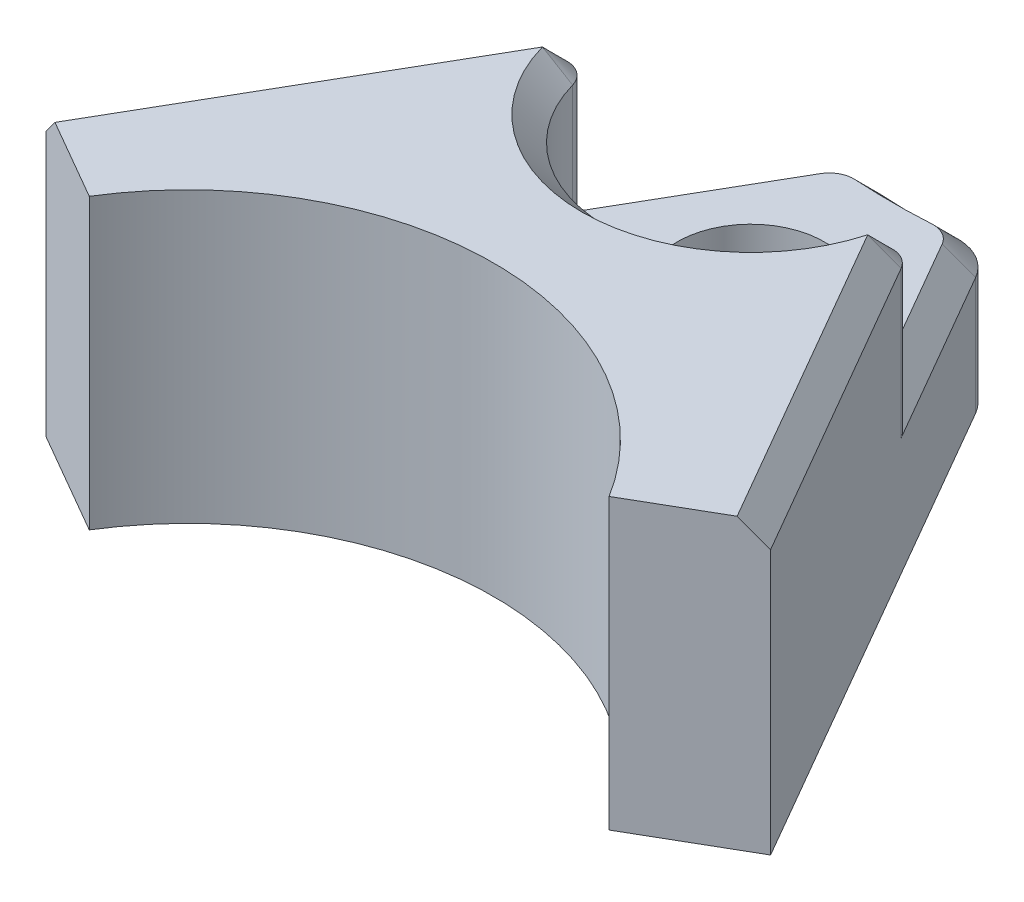
ISO-10303-21;
HEADER;
FILE_DESCRIPTION(('STEP AP214'),'2;1');
FILE_NAME('part.step','',(''),(''),'','','');
FILE_SCHEMA(('AUTOMOTIVE_DESIGN { 1 0 10303 214 1 1 1 1 }'));
ENDSEC;
DATA;
#1=APPLICATION_CONTEXT('core data for automotive mechanical design processes');
#2=APPLICATION_PROTOCOL_DEFINITION('international standard','automotive_design',2000,#1);
#3=PRODUCT_CONTEXT('',#1,'mechanical');
#4=PRODUCT('Part','Part','',(#3));
#5=PRODUCT_RELATED_PRODUCT_CATEGORY('part','',(#4));
#6=PRODUCT_DEFINITION_FORMATION('','',#4);
#7=PRODUCT_DEFINITION_CONTEXT('part definition',#1,'design');
#8=PRODUCT_DEFINITION('design','',#6,#7);
#9=PRODUCT_DEFINITION_SHAPE('','',#8);
#10=(LENGTH_UNIT() NAMED_UNIT(*) SI_UNIT(.MILLI.,.METRE.));
#11=(NAMED_UNIT(*) PLANE_ANGLE_UNIT() SI_UNIT($,.RADIAN.));
#12=(NAMED_UNIT(*) SI_UNIT($,.STERADIAN.) SOLID_ANGLE_UNIT());
#13=UNCERTAINTY_MEASURE_WITH_UNIT(LENGTH_MEASURE(1.E-05),#10,'distance_accuracy_value','');
#14=(GEOMETRIC_REPRESENTATION_CONTEXT(3) GLOBAL_UNCERTAINTY_ASSIGNED_CONTEXT((#13)) GLOBAL_UNIT_ASSIGNED_CONTEXT((#10,
#11,#12)) REPRESENTATION_CONTEXT('',''));
#15=CARTESIAN_POINT('',(0.,0.,0.));
#16=DIRECTION('',(0.,0.,1.));
#17=DIRECTION('',(1.,0.,0.));
#18=AXIS2_PLACEMENT_3D('',#15,#16,#17);
#19=CARTESIAN_POINT('',(0.,5.9,-27.39));
#20=DIRECTION('',(0.,-1.,0.));
#21=DIRECTION('',(0.,0.,-1.));
#22=AXIS2_PLACEMENT_3D('',#19,#20,#21);
#23=CYLINDRICAL_SURFACE('',#22,12.5);
#24=DIRECTION('',(0.,-1.,0.));
#25=VECTOR('',#24,1.);
#26=CARTESIAN_POINT('',(-0.751403671485057,5.9,-14.9126047380682));
#27=LINE('',#26,#25);
#28=CARTESIAN_POINT('',(-0.751403671485057,0.,-14.9126047380682));
#29=VERTEX_POINT('',#28);
#30=CARTESIAN_POINT('',(-0.751403671485057,2.40000000000002,-14.9126047380682));
#31=VERTEX_POINT('',#30);
#32=EDGE_CURVE('E214',#29,#31,#27,.F.);
#33=ORIENTED_EDGE('',*,*,#32,.T.);
#34=CARTESIAN_POINT('',(0.,2.40000000000002,-27.39));
#35=DIRECTION('',(0.,1.,0.));
#36=DIRECTION('',(0.,0.,1.));
#37=AXIS2_PLACEMENT_3D('',#34,#35,#36);
#38=CIRCLE('',#37,12.5);
#39=CARTESIAN_POINT('',(0.751403671485056,2.40000000000002,-14.9126047380682));
#40=VERTEX_POINT('',#39);
#41=EDGE_CURVE('E237',#31,#40,#38,.T.);
#42=ORIENTED_EDGE('',*,*,#41,.T.);
#43=DIRECTION('',(0.,-1.,0.));
#44=VECTOR('',#43,1.);
#45=CARTESIAN_POINT('',(0.751403671485056,5.9,-14.9126047380682));
#46=LINE('',#45,#44);
#47=CARTESIAN_POINT('',(0.751403671485056,0.,-14.9126047380682));
#48=VERTEX_POINT('',#47);
#49=EDGE_CURVE('E212',#40,#48,#46,.T.);
#50=ORIENTED_EDGE('',*,*,#49,.T.);
#51=CARTESIAN_POINT('',(0.,0.,-27.39));
#52=DIRECTION('',(0.,-1.,0.));
#53=DIRECTION('',(0.,0.,1.));
#54=AXIS2_PLACEMENT_3D('',#51,#52,#53);
#55=CIRCLE('',#54,12.5);
#56=EDGE_CURVE('E304',#48,#29,#55,.T.);
#57=ORIENTED_EDGE('',*,*,#56,.T.);
#58=EDGE_LOOP('',(#33,#42,#50,#57));
#59=FACE_BOUND('',#58,.T.);
#60=ADVANCED_FACE('F32',(#59),#23,.F.);
#61=CARTESIAN_POINT('',(0.,5.9,-11.5));
#62=DIRECTION('',(0.,-1.,0.));
#63=DIRECTION('',(0.,0.,-1.));
#64=AXIS2_PLACEMENT_3D('',#61,#62,#63);
#65=CYLINDRICAL_SURFACE('',#64,1.5);
#66=CARTESIAN_POINT('',(0.,0.,-11.5));
#67=DIRECTION('',(0.,1.,0.));
#68=DIRECTION('',(0.,0.,1.));
#69=AXIS2_PLACEMENT_3D('',#66,#67,#68);
#70=CIRCLE('',#69,1.5);
#71=CARTESIAN_POINT('',(0.,0.,-10.));
#72=VERTEX_POINT('',#71);
#73=EDGE_CURVE('E193',#72,#72,#70,.T.);
#74=ORIENTED_EDGE('',*,*,#73,.F.);
#75=EDGE_LOOP('',(#74));
#76=FACE_BOUND('',#75,.T.);
#77=CARTESIAN_POINT('',(0.,2.9,-11.5));
#78=DIRECTION('',(0.,1.,0.));
#79=DIRECTION('',(0.,0.,1.));
#80=AXIS2_PLACEMENT_3D('',#77,#78,#79);
#81=CIRCLE('',#80,1.5);
#82=CARTESIAN_POINT('',(0.,2.9,-10.));
#83=VERTEX_POINT('',#82);
#84=EDGE_CURVE('E191',#83,#83,#81,.T.);
#85=ORIENTED_EDGE('',*,*,#84,.T.);
#86=EDGE_LOOP('',(#85));
#87=FACE_BOUND('',#86,.T.);
#88=ADVANCED_FACE('F383',(#76,#87),#65,.F.);
#89=CARTESIAN_POINT('',(0.,5.9,0.));
#90=DIRECTION('',(0.,-1.,0.));
#91=DIRECTION('',(0.,0.,-1.));
#92=AXIS2_PLACEMENT_3D('',#89,#90,#91);
#93=PLANE('',#92);
#94=CARTESIAN_POINT('',(0.,5.9,-11.5));
#95=DIRECTION('',(0.,-1.,0.));
#96=DIRECTION('',(0.,0.,-1.));
#97=AXIS2_PLACEMENT_3D('',#94,#95,#96);
#98=CIRCLE('',#97,3.45);
#99=CARTESIAN_POINT('',(3.32146315305726,5.9,-10.5670570634369));
#100=VERTEX_POINT('',#99);
#101=CARTESIAN_POINT('',(-3.32146315305726,5.9,-10.5670570634369));
#102=VERTEX_POINT('',#101);
#103=EDGE_CURVE('E248',#100,#102,#98,.T.);
#104=ORIENTED_EDGE('',*,*,#103,.T.);
#105=DIRECTION('',(-0.500000000000001,0.,0.866025403784438));
#106=VECTOR('',#105,1.);
#107=CARTESIAN_POINT('',(-7.06676729488104,5.9,-4.08000000000001));
#108=LINE('',#107,#106);
#109=CARTESIAN_POINT('',(-6.96476970678315,5.9,-4.25666500483504));
#110=VERTEX_POINT('',#109);
#111=EDGE_CURVE('E250',#102,#110,#108,.T.);
#112=ORIENTED_EDGE('',*,*,#111,.T.);
#113=DIRECTION('',(0.866025403784436,0.,0.500000000000004));
#114=VECTOR('',#113,1.);
#115=CARTESIAN_POINT('',(-5.30777731258575,5.9,-3.3));
#116=LINE('',#115,#114);
#117=CARTESIAN_POINT('',(-5.30777731258575,5.9,-3.3));
#118=VERTEX_POINT('',#117);
#119=EDGE_CURVE('E166',#110,#118,#116,.T.);
#120=ORIENTED_EDGE('',*,*,#119,.T.);
#121=CARTESIAN_POINT('',(0.,5.9,0.));
#122=DIRECTION('',(0.,-1.,0.));
#123=DIRECTION('',(0.,0.,-1.));
#124=AXIS2_PLACEMENT_3D('',#121,#122,#123);
#125=CIRCLE('',#124,6.25000000000001);
#126=CARTESIAN_POINT('',(5.30777731258575,5.9,-3.3));
#127=VERTEX_POINT('',#126);
#128=EDGE_CURVE('E167',#118,#127,#125,.T.);
#129=ORIENTED_EDGE('',*,*,#128,.T.);
#130=DIRECTION('',(0.866025403784436,0.,-0.500000000000004));
#131=VECTOR('',#130,1.);
#132=CARTESIAN_POINT('',(5.30777731258575,5.9,-3.3));
#133=LINE('',#132,#131);
#134=CARTESIAN_POINT('',(6.96476970678315,5.9,-4.25666500483504));
#135=VERTEX_POINT('',#134);
#136=EDGE_CURVE('E154',#127,#135,#133,.T.);
#137=ORIENTED_EDGE('',*,*,#136,.T.);
#138=DIRECTION('',(-0.500000000000001,0.,-0.866025403784438));
#139=VECTOR('',#138,1.);
#140=CARTESIAN_POINT('',(7.06676729488104,5.9,-4.08000000000002));
#141=LINE('',#140,#139);
#142=EDGE_CURVE('E246',#135,#100,#141,.T.);
#143=ORIENTED_EDGE('',*,*,#142,.T.);
#144=EDGE_LOOP('',(#104,#112,#120,#129,#137,#143));
#145=FACE_BOUND('',#144,.T.);
#146=ADVANCED_FACE('F170',(#145),#93,.F.);
#147=CARTESIAN_POINT('',(0.,0.,0.));
#148=DIRECTION('',(0.,-1.,0.));
#149=DIRECTION('',(0.,0.,-1.));
#150=AXIS2_PLACEMENT_3D('',#147,#148,#149);
#151=PLANE('',#150);
#152=DIRECTION('',(-0.500000000000001,0.,0.866025403784438));
#153=VECTOR('',#152,1.);
#154=CARTESIAN_POINT('',(-7.39778240867536,0.,-4.50666500483504));
#155=LINE('',#154,#153);
#156=CARTESIAN_POINT('',(-1.6775413689883,0.,-14.4144131171136));
#157=VERTEX_POINT('',#156);
#158=CARTESIAN_POINT('',(-7.39778240867536,0.,-4.50666500483504));
#159=VERTEX_POINT('',#158);
#160=EDGE_CURVE('E307',#157,#159,#155,.T.);
#161=ORIENTED_EDGE('',*,*,#160,.F.);
#162=CARTESIAN_POINT('',(-0.811515965203861,0.,-13.9144131171136));
#163=DIRECTION('',(0.,-1.,0.));
#164=DIRECTION('',(0.,0.,-1.));
#165=AXIS2_PLACEMENT_3D('',#162,#163,#164);
#166=CIRCLE('',#165,1.);
#167=EDGE_CURVE('E210',#157,#29,#166,.T.);
#168=ORIENTED_EDGE('',*,*,#167,.T.);
#169=ORIENTED_EDGE('',*,*,#56,.F.);
#170=CARTESIAN_POINT('',(0.811515965203861,0.,-13.9144131171136));
#171=DIRECTION('',(0.,-1.,0.));
#172=DIRECTION('',(0.,0.,-1.));
#173=AXIS2_PLACEMENT_3D('',#170,#171,#172);
#174=CIRCLE('',#173,1.);
#175=CARTESIAN_POINT('',(1.6775413689883,0.,-14.4144131171136));
#176=VERTEX_POINT('',#175);
#177=EDGE_CURVE('E208',#48,#176,#174,.T.);
#178=ORIENTED_EDGE('',*,*,#177,.T.);
#179=DIRECTION('',(-0.500000000000001,0.,-0.866025403784438));
#180=VECTOR('',#179,1.);
#181=CARTESIAN_POINT('',(7.39778240867537,0.,-4.50666500483504));
#182=LINE('',#181,#180);
#183=CARTESIAN_POINT('',(7.39778240867537,0.,-4.50666500483504));
#184=VERTEX_POINT('',#183);
#185=EDGE_CURVE('E296',#184,#176,#182,.T.);
#186=ORIENTED_EDGE('',*,*,#185,.F.);
#187=DIRECTION('',(0.866025403784436,0.,-0.500000000000004));
#188=VECTOR('',#187,1.);
#189=CARTESIAN_POINT('',(5.30777731258575,0.,-3.3));
#190=LINE('',#189,#188);
#191=CARTESIAN_POINT('',(5.30777731258575,0.,-3.3));
#192=VERTEX_POINT('',#191);
#193=EDGE_CURVE('E293',#192,#184,#190,.T.);
#194=ORIENTED_EDGE('',*,*,#193,.F.);
#195=CARTESIAN_POINT('',(0.,0.,0.));
#196=DIRECTION('',(0.,-1.,0.));
#197=DIRECTION('',(0.,0.,-1.));
#198=AXIS2_PLACEMENT_3D('',#195,#196,#197);
#199=CIRCLE('',#198,6.25000000000001);
#200=CARTESIAN_POINT('',(-5.30777731258575,0.,-3.3));
#201=VERTEX_POINT('',#200);
#202=EDGE_CURVE('E180',#201,#192,#199,.T.);
#203=ORIENTED_EDGE('',*,*,#202,.F.);
#204=DIRECTION('',(0.866025403784436,0.,0.500000000000004));
#205=VECTOR('',#204,1.);
#206=CARTESIAN_POINT('',(-5.30777731258575,0.,-3.3));
#207=LINE('',#206,#205);
#208=EDGE_CURVE('E176',#159,#201,#207,.T.);
#209=ORIENTED_EDGE('',*,*,#208,.F.);
#210=EDGE_LOOP('',(#161,#168,#169,#178,#186,#194,#203,#209));
#211=FACE_BOUND('',#210,.T.);
#212=ORIENTED_EDGE('',*,*,#73,.T.);
#213=EDGE_LOOP('',(#212));
#214=FACE_BOUND('',#213,.T.);
#215=ADVANCED_FACE('F299',(#211,#214),#151,.T.);
#216=CARTESIAN_POINT('',(0.,5.9,0.));
#217=DIRECTION('',(0.,-1.,0.));
#218=DIRECTION('',(0.,0.,-1.));
#219=AXIS2_PLACEMENT_3D('',#216,#217,#218);
#220=CYLINDRICAL_SURFACE('',#219,6.25000000000001);
#221=ORIENTED_EDGE('',*,*,#202,.T.);
#222=DIRECTION('',(0.,-1.,0.));
#223=VECTOR('',#222,1.);
#224=CARTESIAN_POINT('',(5.30777731258575,5.9,-3.3));
#225=LINE('',#224,#223);
#226=EDGE_CURVE('E160',#127,#192,#225,.T.);
#227=ORIENTED_EDGE('',*,*,#226,.F.);
#228=ORIENTED_EDGE('',*,*,#128,.F.);
#229=DIRECTION('',(0.,-1.,0.));
#230=VECTOR('',#229,1.);
#231=CARTESIAN_POINT('',(-5.30777731258575,5.9,-3.3));
#232=LINE('',#231,#230);
#233=EDGE_CURVE('E314',#118,#201,#232,.T.);
#234=ORIENTED_EDGE('',*,*,#233,.T.);
#235=EDGE_LOOP('',(#221,#227,#228,#234));
#236=FACE_BOUND('',#235,.T.);
#237=ADVANCED_FACE('F178',(#236),#220,.F.);
#238=CARTESIAN_POINT('',(5.30777731258575,5.9,-3.3));
#239=DIRECTION('',(-0.500000000000005,0.,-0.866025403784436));
#240=DIRECTION('',(-0.866025403784436,0.,0.500000000000005));
#241=AXIS2_PLACEMENT_3D('',#238,#239,#240);
#242=PLANE('',#241);
#243=DIRECTION('',(0.,-1.,0.));
#244=VECTOR('',#243,1.);
#245=CARTESIAN_POINT('',(7.39778240867537,5.9,-4.50666500483504));
#246=LINE('',#245,#244);
#247=CARTESIAN_POINT('',(7.39778240867537,5.4,-4.50666500483504));
#248=VERTEX_POINT('',#247);
#249=EDGE_CURVE('E182',#248,#184,#246,.T.);
#250=ORIENTED_EDGE('',*,*,#249,.F.);
#251=DIRECTION('',(0.612372435695791,-0.70710678118655,-0.353553390593276));
#252=VECTOR('',#251,1.);
#253=CARTESIAN_POINT('',(6.96476970678315,5.9,-4.25666500483504));
#254=LINE('',#253,#252);
#255=EDGE_CURVE('E163',#248,#135,#254,.F.);
#256=ORIENTED_EDGE('',*,*,#255,.T.);
#257=ORIENTED_EDGE('',*,*,#136,.F.);
#258=ORIENTED_EDGE('',*,*,#226,.T.);
#259=ORIENTED_EDGE('',*,*,#193,.T.);
#260=EDGE_LOOP('',(#250,#256,#257,#258,#259));
#261=FACE_BOUND('',#260,.T.);
#262=ADVANCED_FACE('F157',(#261),#242,.F.);
#263=CARTESIAN_POINT('',(7.39778240867537,5.9,-4.50666500483504));
#264=DIRECTION('',(-0.866025403784438,0.,0.500000000000001));
#265=DIRECTION('',(0.500000000000001,0.,0.866025403784438));
#266=AXIS2_PLACEMENT_3D('',#263,#264,#265);
#267=PLANE('',#266);
#268=DIRECTION('',(0.,-1.,0.));
#269=VECTOR('',#268,1.);
#270=CARTESIAN_POINT('',(1.6775413689883,5.9,-14.4144131171136));
#271=LINE('',#270,#269);
#272=CARTESIAN_POINT('',(1.6775413689883,2.40000000000002,-14.4144131171136));
#273=VERTEX_POINT('',#272);
#274=EDGE_CURVE('E217',#176,#273,#271,.F.);
#275=ORIENTED_EDGE('',*,*,#274,.T.);
#276=DIRECTION('',(0.500000000000001,0.,0.866025403784438));
#277=VECTOR('',#276,1.);
#278=CARTESIAN_POINT('',(3.75447585494948,2.40000000000002,-10.8170570634369));
#279=LINE('',#278,#277);
#280=CARTESIAN_POINT('',(3.75447585494948,2.40000000000002,-10.8170570634369));
#281=VERTEX_POINT('',#280);
#282=EDGE_CURVE('E243',#273,#281,#279,.T.);
#283=ORIENTED_EDGE('',*,*,#282,.T.);
#284=DIRECTION('',(0.,1.,0.));
#285=VECTOR('',#284,1.);
#286=CARTESIAN_POINT('',(3.75447585494948,5.9,-10.8170570634369));
#287=LINE('',#286,#285);
#288=CARTESIAN_POINT('',(3.75447585494948,5.4,-10.8170570634369));
#289=VERTEX_POINT('',#288);
#290=EDGE_CURVE('E181',#281,#289,#287,.T.);
#291=ORIENTED_EDGE('',*,*,#290,.T.);
#292=DIRECTION('',(0.500000000000001,0.,0.866025403784438));
#293=VECTOR('',#292,1.);
#294=CARTESIAN_POINT('',(7.39778240867537,5.4,-4.50666500483504));
#295=LINE('',#294,#293);
#296=EDGE_CURVE('E241',#289,#248,#295,.T.);
#297=ORIENTED_EDGE('',*,*,#296,.T.);
#298=ORIENTED_EDGE('',*,*,#249,.T.);
#299=ORIENTED_EDGE('',*,*,#185,.T.);
#300=EDGE_LOOP('',(#275,#283,#291,#297,#298,#299));
#301=FACE_BOUND('',#300,.T.);
#302=ADVANCED_FACE('F291',(#301),#267,.F.);
#303=CARTESIAN_POINT('',(-7.39778240867536,5.9,-4.50666500483504));
#304=DIRECTION('',(0.866025403784438,0.,0.500000000000001));
#305=DIRECTION('',(0.500000000000001,0.,-0.866025403784438));
#306=AXIS2_PLACEMENT_3D('',#303,#304,#305);
#307=PLANE('',#306);
#308=DIRECTION('',(0.,1.,0.));
#309=VECTOR('',#308,1.);
#310=CARTESIAN_POINT('',(-3.75447585494948,5.9,-10.8170570634369));
#311=LINE('',#310,#309);
#312=CARTESIAN_POINT('',(-3.75447585494948,5.4,-10.8170570634369));
#313=VERTEX_POINT('',#312);
#314=CARTESIAN_POINT('',(-3.75447585494948,2.40000000000002,-10.8170570634369));
#315=VERTEX_POINT('',#314);
#316=EDGE_CURVE('E199',#313,#315,#311,.F.);
#317=ORIENTED_EDGE('',*,*,#316,.T.);
#318=DIRECTION('',(0.500000000000001,0.,-0.866025403784438));
#319=VECTOR('',#318,1.);
#320=CARTESIAN_POINT('',(-1.6775413689883,2.40000000000002,-14.4144131171136));
#321=LINE('',#320,#319);
#322=CARTESIAN_POINT('',(-1.6775413689883,2.40000000000002,-14.4144131171136));
#323=VERTEX_POINT('',#322);
#324=EDGE_CURVE('E233',#315,#323,#321,.T.);
#325=ORIENTED_EDGE('',*,*,#324,.T.);
#326=DIRECTION('',(0.,-1.,0.));
#327=VECTOR('',#326,1.);
#328=CARTESIAN_POINT('',(-1.6775413689883,5.9,-14.4144131171136));
#329=LINE('',#328,#327);
#330=EDGE_CURVE('E206',#323,#157,#329,.T.);
#331=ORIENTED_EDGE('',*,*,#330,.T.);
#332=ORIENTED_EDGE('',*,*,#160,.T.);
#333=DIRECTION('',(0.,-1.,0.));
#334=VECTOR('',#333,1.);
#335=CARTESIAN_POINT('',(-7.39778240867536,5.9,-4.50666500483504));
#336=LINE('',#335,#334);
#337=CARTESIAN_POINT('',(-7.39778240867536,5.4,-4.50666500483504));
#338=VERTEX_POINT('',#337);
#339=EDGE_CURVE('E187',#338,#159,#336,.T.);
#340=ORIENTED_EDGE('',*,*,#339,.F.);
#341=DIRECTION('',(0.500000000000001,0.,-0.866025403784438));
#342=VECTOR('',#341,1.);
#343=CARTESIAN_POINT('',(-7.39778240867536,5.4,-4.50666500483504));
#344=LINE('',#343,#342);
#345=EDGE_CURVE('E231',#338,#313,#344,.T.);
#346=ORIENTED_EDGE('',*,*,#345,.T.);
#347=EDGE_LOOP('',(#317,#325,#331,#332,#340,#346));
#348=FACE_BOUND('',#347,.T.);
#349=ADVANCED_FACE('F321',(#348),#307,.F.);
#350=CARTESIAN_POINT('',(-5.30777731258575,5.9,-3.3));
#351=DIRECTION('',(0.500000000000005,0.,-0.866025403784436));
#352=DIRECTION('',(-0.866025403784436,0.,-0.500000000000005));
#353=AXIS2_PLACEMENT_3D('',#350,#351,#352);
#354=PLANE('',#353);
#355=ORIENTED_EDGE('',*,*,#119,.F.);
#356=DIRECTION('',(0.612372435695791,0.70710678118655,0.353553390593276));
#357=VECTOR('',#356,1.);
#358=CARTESIAN_POINT('',(-6.96476970678315,5.9,-4.25666500483504));
#359=LINE('',#358,#357);
#360=EDGE_CURVE('E252',#110,#338,#359,.F.);
#361=ORIENTED_EDGE('',*,*,#360,.T.);
#362=ORIENTED_EDGE('',*,*,#339,.T.);
#363=ORIENTED_EDGE('',*,*,#208,.T.);
#364=ORIENTED_EDGE('',*,*,#233,.F.);
#365=EDGE_LOOP('',(#355,#361,#362,#363,#364));
#366=FACE_BOUND('',#365,.T.);
#367=ADVANCED_FACE('F317',(#366),#354,.F.);
#368=CARTESIAN_POINT('',(0.,2.9,-11.5));
#369=DIRECTION('',(0.,1.,0.));
#370=DIRECTION('',(0.,0.,1.));
#371=AXIS2_PLACEMENT_3D('',#368,#369,#370);
#372=CYLINDRICAL_SURFACE('',#371,2.95);
#373=DIRECTION('',(0.,1.,0.));
#374=VECTOR('',#373,1.);
#375=CARTESIAN_POINT('',(-2.84009168159969,2.9,-10.702266184678));
#376=LINE('',#375,#374);
#377=CARTESIAN_POINT('',(-2.84009168159969,2.9,-10.702266184678));
#378=VERTEX_POINT('',#377);
#379=CARTESIAN_POINT('',(-2.84009168159969,5.4,-10.702266184678));
#380=VERTEX_POINT('',#379);
#381=EDGE_CURVE('E185',#378,#380,#376,.T.);
#382=ORIENTED_EDGE('',*,*,#381,.T.);
#383=CARTESIAN_POINT('',(0.,5.4,-11.5));
#384=DIRECTION('',(0.,-1.,0.));
#385=DIRECTION('',(0.,0.,-1.));
#386=AXIS2_PLACEMENT_3D('',#383,#384,#385);
#387=CIRCLE('',#386,2.95);
#388=CARTESIAN_POINT('',(2.84009168159969,5.4,-10.702266184678));
#389=VERTEX_POINT('',#388);
#390=EDGE_CURVE('E49',#380,#389,#387,.F.);
#391=ORIENTED_EDGE('',*,*,#390,.T.);
#392=DIRECTION('',(0.,1.,0.));
#393=VECTOR('',#392,1.);
#394=CARTESIAN_POINT('',(2.84009168159969,2.9,-10.702266184678));
#395=LINE('',#394,#393);
#396=CARTESIAN_POINT('',(2.84009168159969,2.9,-10.702266184678));
#397=VERTEX_POINT('',#396);
#398=EDGE_CURVE('E197',#389,#397,#395,.F.);
#399=ORIENTED_EDGE('',*,*,#398,.T.);
#400=CARTESIAN_POINT('',(0.,2.9,-11.5));
#401=DIRECTION('',(0.,1.,0.));
#402=DIRECTION('',(0.,0.,1.));
#403=AXIS2_PLACEMENT_3D('',#400,#401,#402);
#404=CIRCLE('',#403,2.95);
#405=EDGE_CURVE('E194',#378,#397,#404,.T.);
#406=ORIENTED_EDGE('',*,*,#405,.F.);
#407=EDGE_LOOP('',(#382,#391,#399,#406));
#408=FACE_BOUND('',#407,.T.);
#409=ADVANCED_FACE('F361',(#408),#372,.F.);
#410=CARTESIAN_POINT('',(0.,2.9,-11.5));
#411=DIRECTION('',(0.,1.,0.));
#412=DIRECTION('',(0.,0.,1.));
#413=AXIS2_PLACEMENT_3D('',#410,#411,#412);
#414=PLANE('',#413);
#415=ORIENTED_EDGE('',*,*,#84,.F.);
#416=EDGE_LOOP('',(#415));
#417=FACE_BOUND('',#416,.T.);
#418=CARTESIAN_POINT('',(-0.811515965203861,2.9,-13.9144131171136));
#419=DIRECTION('',(0.,1.,0.));
#420=DIRECTION('',(0.,0.,1.));
#421=AXIS2_PLACEMENT_3D('',#418,#419,#420);
#422=CIRCLE('',#421,0.500000000000018);
#423=CARTESIAN_POINT('',(-0.781459818344458,2.9,-14.4135089275909));
#424=VERTEX_POINT('',#423);
#425=CARTESIAN_POINT('',(-1.24452866709609,2.9,-14.1644131171136));
#426=VERTEX_POINT('',#425);
#427=EDGE_CURVE('E226',#424,#426,#422,.T.);
#428=ORIENTED_EDGE('',*,*,#427,.T.);
#429=DIRECTION('',(-0.500000000000001,0.,0.866025403784438));
#430=VECTOR('',#429,1.);
#431=CARTESIAN_POINT('',(-3.32146315305727,2.9,-10.5670570634369));
#432=LINE('',#431,#430);
#433=CARTESIAN_POINT('',(-3.07146315305727,2.9,-11.0000697653292));
#434=VERTEX_POINT('',#433);
#435=EDGE_CURVE('E228',#426,#434,#432,.T.);
#436=ORIENTED_EDGE('',*,*,#435,.T.);
#437=CARTESIAN_POINT('',(-3.32146315305726,2.9,-10.5670570634369));
#438=DIRECTION('',(0.,1.,0.));
#439=DIRECTION('',(0.,0.,1.));
#440=AXIS2_PLACEMENT_3D('',#437,#438,#439);
#441=CIRCLE('',#440,0.5);
#442=EDGE_CURVE('E204',#434,#378,#441,.F.);
#443=ORIENTED_EDGE('',*,*,#442,.T.);
#444=ORIENTED_EDGE('',*,*,#405,.T.);
#445=CARTESIAN_POINT('',(3.32146315305726,2.9,-10.5670570634369));
#446=DIRECTION('',(0.,1.,0.));
#447=DIRECTION('',(0.,0.,1.));
#448=AXIS2_PLACEMENT_3D('',#445,#446,#447);
#449=CIRCLE('',#448,0.5);
#450=CARTESIAN_POINT('',(3.07146315305728,2.9,-11.0000697653292));
#451=VERTEX_POINT('',#450);
#452=EDGE_CURVE('E201',#397,#451,#449,.F.);
#453=ORIENTED_EDGE('',*,*,#452,.T.);
#454=DIRECTION('',(-0.500000000000001,0.,-0.866025403784438));
#455=VECTOR('',#454,1.);
#456=CARTESIAN_POINT('',(1.2445286670961,2.9,-14.1644131171136));
#457=LINE('',#456,#455);
#458=CARTESIAN_POINT('',(1.2445286670961,2.9,-14.1644131171136));
#459=VERTEX_POINT('',#458);
#460=EDGE_CURVE('E220',#451,#459,#457,.T.);
#461=ORIENTED_EDGE('',*,*,#460,.T.);
#462=CARTESIAN_POINT('',(0.811515965203861,2.9,-13.9144131171136));
#463=DIRECTION('',(0.,1.,0.));
#464=DIRECTION('',(0.,0.,1.));
#465=AXIS2_PLACEMENT_3D('',#462,#463,#464);
#466=CIRCLE('',#465,0.500000000000018);
#467=CARTESIAN_POINT('',(0.781459818344458,2.9,-14.4135089275909));
#468=VERTEX_POINT('',#467);
#469=EDGE_CURVE('E222',#459,#468,#466,.T.);
#470=ORIENTED_EDGE('',*,*,#469,.T.);
#471=CARTESIAN_POINT('',(0.,2.9,-27.39));
#472=DIRECTION('',(0.,1.,0.));
#473=DIRECTION('',(0.,0.,1.));
#474=AXIS2_PLACEMENT_3D('',#471,#472,#473);
#475=CIRCLE('',#474,13.);
#476=EDGE_CURVE('E224',#468,#424,#475,.F.);
#477=ORIENTED_EDGE('',*,*,#476,.T.);
#478=EDGE_LOOP('',(#428,#436,#443,#444,#453,#461,#470,#477));
#479=FACE_BOUND('',#478,.T.);
#480=ADVANCED_FACE('F332',(#417,#479),#414,.T.);
#481=CARTESIAN_POINT('',(3.32146315305726,2.9,-10.5670570634369));
#482=DIRECTION('',(0.,1.,0.));
#483=DIRECTION('',(0.,0.,1.));
#484=AXIS2_PLACEMENT_3D('',#481,#482,#483);
#485=CYLINDRICAL_SURFACE('',#484,0.5);
#486=ORIENTED_EDGE('',*,*,#398,.F.);
#487=CARTESIAN_POINT('',(3.32146315305726,5.4,-10.5670570634369));
#488=DIRECTION('',(0.,-1.,0.));
#489=DIRECTION('',(0.,0.,-1.));
#490=AXIS2_PLACEMENT_3D('',#487,#488,#489);
#491=CIRCLE('',#490,0.5);
#492=EDGE_CURVE('E256',#389,#289,#491,.T.);
#493=ORIENTED_EDGE('',*,*,#492,.T.);
#494=ORIENTED_EDGE('',*,*,#290,.F.);
#495=CARTESIAN_POINT('',(3.32146315305726,2.90000000000002,-10.5670570634369));
#496=DIRECTION('',(0.612372435695796,0.707106781186545,-0.353553390593276));
#497=DIRECTION('',(-0.612372435695792,0.70710678118655,0.353553390593273));
#498=AXIS2_PLACEMENT_3D('',#495,#496,#497);
#499=ELLIPSE('',#498,0.70710678118655,0.5);
#500=EDGE_CURVE('E11',#281,#451,#499,.T.);
#501=ORIENTED_EDGE('',*,*,#500,.T.);
#502=ORIENTED_EDGE('',*,*,#452,.F.);
#503=EDGE_LOOP('',(#486,#493,#494,#501,#502));
#504=FACE_BOUND('',#503,.T.);
#505=ADVANCED_FACE('F336',(#504),#485,.T.);
#506=CARTESIAN_POINT('',(-3.32146315305726,2.9,-10.5670570634369));
#507=DIRECTION('',(0.,1.,0.));
#508=DIRECTION('',(0.,0.,1.));
#509=AXIS2_PLACEMENT_3D('',#506,#507,#508);
#510=CYLINDRICAL_SURFACE('',#509,0.5);
#511=ORIENTED_EDGE('',*,*,#316,.F.);
#512=CARTESIAN_POINT('',(-3.32146315305726,5.4,-10.5670570634369));
#513=DIRECTION('',(0.,-1.,0.));
#514=DIRECTION('',(0.,0.,-1.));
#515=AXIS2_PLACEMENT_3D('',#512,#513,#514);
#516=CIRCLE('',#515,0.5);
#517=EDGE_CURVE('E57',#313,#380,#516,.T.);
#518=ORIENTED_EDGE('',*,*,#517,.T.);
#519=ORIENTED_EDGE('',*,*,#381,.F.);
#520=ORIENTED_EDGE('',*,*,#442,.F.);
#521=CARTESIAN_POINT('',(-3.32146315305726,2.90000000000002,-10.5670570634369));
#522=DIRECTION('',(-0.612372435695795,0.707106781186547,-0.353553390593275));
#523=DIRECTION('',(0.612372435695794,0.707106781186548,0.353553390593274));
#524=AXIS2_PLACEMENT_3D('',#521,#522,#523);
#525=ELLIPSE('',#524,0.707106781186548,0.5);
#526=EDGE_CURVE('E41',#434,#315,#525,.T.);
#527=ORIENTED_EDGE('',*,*,#526,.T.);
#528=EDGE_LOOP('',(#511,#518,#519,#520,#527));
#529=FACE_BOUND('',#528,.T.);
#530=ADVANCED_FACE('F359',(#529),#510,.T.);
#531=CARTESIAN_POINT('',(-0.811515965203861,5.9,-13.9144131171136));
#532=DIRECTION('',(0.,-1.,0.));
#533=DIRECTION('',(0.,0.,-1.));
#534=AXIS2_PLACEMENT_3D('',#531,#532,#533);
#535=CYLINDRICAL_SURFACE('',#534,1.);
#536=ORIENTED_EDGE('',*,*,#330,.F.);
#537=CARTESIAN_POINT('',(-0.811515965203861,2.40000000000002,-13.9144131171136));
#538=DIRECTION('',(0.,1.,0.));
#539=DIRECTION('',(0.,0.,1.));
#540=AXIS2_PLACEMENT_3D('',#537,#538,#539);
#541=CIRCLE('',#540,1.);
#542=EDGE_CURVE('E235',#323,#31,#541,.F.);
#543=ORIENTED_EDGE('',*,*,#542,.T.);
#544=ORIENTED_EDGE('',*,*,#32,.F.);
#545=ORIENTED_EDGE('',*,*,#167,.F.);
#546=EDGE_LOOP('',(#536,#543,#544,#545));
#547=FACE_BOUND('',#546,.T.);
#548=ADVANCED_FACE('F371',(#547),#535,.T.);
#549=CARTESIAN_POINT('',(0.811515965203861,5.9,-13.9144131171136));
#550=DIRECTION('',(0.,-1.,0.));
#551=DIRECTION('',(0.,0.,-1.));
#552=AXIS2_PLACEMENT_3D('',#549,#550,#551);
#553=CYLINDRICAL_SURFACE('',#552,1.);
#554=ORIENTED_EDGE('',*,*,#49,.F.);
#555=CARTESIAN_POINT('',(0.811515965203861,2.40000000000002,-13.9144131171136));
#556=DIRECTION('',(0.,1.,0.));
#557=DIRECTION('',(0.,0.,1.));
#558=AXIS2_PLACEMENT_3D('',#555,#556,#557);
#559=CIRCLE('',#558,1.);
#560=EDGE_CURVE('E239',#40,#273,#559,.F.);
#561=ORIENTED_EDGE('',*,*,#560,.T.);
#562=ORIENTED_EDGE('',*,*,#274,.F.);
#563=ORIENTED_EDGE('',*,*,#177,.F.);
#564=EDGE_LOOP('',(#554,#561,#562,#563));
#565=FACE_BOUND('',#564,.T.);
#566=ADVANCED_FACE('F405',(#565),#553,.T.);
#567=CARTESIAN_POINT('',(2.08712122312052,2.9,-12.705));
#568=DIRECTION('',(0.612372435695796,0.707106781186545,-0.353553390593276));
#569=DIRECTION('',(0.500000000000001,0.,0.866025403784438));
#570=AXIS2_PLACEMENT_3D('',#567,#568,#569);
#571=PLANE('',#570);
#572=ORIENTED_EDGE('',*,*,#500,.F.);
#573=ORIENTED_EDGE('',*,*,#282,.F.);
#574=DIRECTION('',(0.612372435695792,-0.707106781186549,-0.353553390593275));
#575=VECTOR('',#574,1.);
#576=CARTESIAN_POINT('',(1.2445286670961,2.9,-14.1644131171136));
#577=LINE('',#576,#575);
#578=EDGE_CURVE('E270',#459,#273,#577,.T.);
#579=ORIENTED_EDGE('',*,*,#578,.F.);
#580=ORIENTED_EDGE('',*,*,#460,.F.);
#581=EDGE_LOOP('',(#572,#573,#579,#580));
#582=FACE_BOUND('',#581,.T.);
#583=ADVANCED_FACE('F340',(#582),#571,.T.);
#584=CARTESIAN_POINT('',(0.811515965203861,2.9,-13.9144131171136));
#585=DIRECTION('',(0.,-1.,0.));
#586=DIRECTION('',(0.,0.,-1.));
#587=AXIS2_PLACEMENT_3D('',#584,#585,#586);
#588=CONICAL_SURFACE('',#587,0.500000000000018,0.785398163397446);
#589=ORIENTED_EDGE('',*,*,#578,.T.);
#590=ORIENTED_EDGE('',*,*,#560,.F.);
#591=DIRECTION('',(-0.0425058105212439,-0.70710678118655,-0.705828064100549));
#592=VECTOR('',#591,1.);
#593=CARTESIAN_POINT('',(0.781459818344458,2.9,-14.4135089275909));
#594=LINE('',#593,#592);
#595=EDGE_CURVE('E267',#468,#40,#594,.T.);
#596=ORIENTED_EDGE('',*,*,#595,.F.);
#597=ORIENTED_EDGE('',*,*,#469,.F.);
#598=EDGE_LOOP('',(#589,#590,#596,#597));
#599=FACE_BOUND('',#598,.T.);
#600=ADVANCED_FACE('F348',(#599),#588,.T.);
#601=CARTESIAN_POINT('',(0.,2.9,-27.39));
#602=DIRECTION('',(0.,1.,0.));
#603=DIRECTION('',(0.,0.,1.));
#604=AXIS2_PLACEMENT_3D('',#601,#602,#603);
#605=CONICAL_SURFACE('',#604,13.,0.785398163397448);
#606=ORIENTED_EDGE('',*,*,#595,.T.);
#607=ORIENTED_EDGE('',*,*,#41,.F.);
#608=DIRECTION('',(0.042505810521244,-0.707106781186547,-0.705828064100551));
#609=VECTOR('',#608,1.);
#610=CARTESIAN_POINT('',(-0.781459818344458,2.9,-14.4135089275909));
#611=LINE('',#610,#609);
#612=EDGE_CURVE('E264',#424,#31,#611,.T.);
#613=ORIENTED_EDGE('',*,*,#612,.F.);
#614=ORIENTED_EDGE('',*,*,#476,.F.);
#615=EDGE_LOOP('',(#606,#607,#613,#614));
#616=FACE_BOUND('',#615,.T.);
#617=ADVANCED_FACE('F351',(#616),#605,.F.);
#618=CARTESIAN_POINT('',(-0.811515965203861,2.9,-13.9144131171136));
#619=DIRECTION('',(0.,-1.,0.));
#620=DIRECTION('',(0.,0.,-1.));
#621=AXIS2_PLACEMENT_3D('',#618,#619,#620);
#622=CONICAL_SURFACE('',#621,0.500000000000018,0.785398163397446);
#623=ORIENTED_EDGE('',*,*,#612,.T.);
#624=ORIENTED_EDGE('',*,*,#542,.F.);
#625=DIRECTION('',(-0.612372435695793,-0.707106781186549,-0.353553390593273));
#626=VECTOR('',#625,1.);
#627=CARTESIAN_POINT('',(-1.24452866709609,2.9,-14.1644131171136));
#628=LINE('',#627,#626);
#629=EDGE_CURVE('E261',#426,#323,#628,.T.);
#630=ORIENTED_EDGE('',*,*,#629,.F.);
#631=ORIENTED_EDGE('',*,*,#427,.F.);
#632=EDGE_LOOP('',(#623,#624,#630,#631));
#633=FACE_BOUND('',#632,.T.);
#634=ADVANCED_FACE('F356',(#633),#622,.T.);
#635=CARTESIAN_POINT('',(-2.08712122312052,2.9,-12.705));
#636=DIRECTION('',(-0.612372435695795,0.707106781186547,-0.353553390593275));
#637=DIRECTION('',(0.500000000000001,0.,-0.866025403784438));
#638=AXIS2_PLACEMENT_3D('',#635,#636,#637);
#639=PLANE('',#638);
#640=ORIENTED_EDGE('',*,*,#629,.T.);
#641=ORIENTED_EDGE('',*,*,#324,.F.);
#642=ORIENTED_EDGE('',*,*,#526,.F.);
#643=ORIENTED_EDGE('',*,*,#435,.F.);
#644=EDGE_LOOP('',(#640,#641,#642,#643));
#645=FACE_BOUND('',#644,.T.);
#646=ADVANCED_FACE('F373',(#645),#639,.T.);
#647=CARTESIAN_POINT('',(7.06676729488104,5.9,-4.08000000000002));
#648=DIRECTION('',(-0.612372435695796,-0.707106781186545,0.353553390593276));
#649=DIRECTION('',(-0.500000000000001,0.,-0.866025403784438));
#650=AXIS2_PLACEMENT_3D('',#647,#648,#649);
#651=PLANE('',#650);
#652=ORIENTED_EDGE('',*,*,#255,.F.);
#653=ORIENTED_EDGE('',*,*,#296,.F.);
#654=DIRECTION('',(0.612372435695792,-0.70710678118655,-0.353553390593273));
#655=VECTOR('',#654,1.);
#656=CARTESIAN_POINT('',(3.32146315305726,5.9,-10.5670570634369));
#657=LINE('',#656,#655);
#658=EDGE_CURVE('E36',#100,#289,#657,.T.);
#659=ORIENTED_EDGE('',*,*,#658,.F.);
#660=ORIENTED_EDGE('',*,*,#142,.F.);
#661=EDGE_LOOP('',(#652,#653,#659,#660));
#662=FACE_BOUND('',#661,.T.);
#663=ADVANCED_FACE('F34',(#662),#651,.F.);
#664=CARTESIAN_POINT('',(3.32146315305726,5.4,-10.5670570634369));
#665=DIRECTION('',(0.,-1.,0.));
#666=DIRECTION('',(0.,0.,-1.));
#667=AXIS2_PLACEMENT_3D('',#664,#665,#666);
#668=CONICAL_SURFACE('',#667,0.499999999999999,0.785398163397447);
#669=ORIENTED_EDGE('',*,*,#658,.T.);
#670=ORIENTED_EDGE('',*,*,#492,.F.);
#671=DIRECTION('',(-0.680762063474793,-0.707106781186549,-0.191214573015606));
#672=VECTOR('',#671,1.);
#673=CARTESIAN_POINT('',(3.32146315305726,5.9,-10.5670570634369));
#674=LINE('',#673,#672);
#675=EDGE_CURVE('E278',#100,#389,#674,.T.);
#676=ORIENTED_EDGE('',*,*,#675,.F.);
#677=EDGE_LOOP('',(#669,#670,#676));
#678=FACE_BOUND('',#677,.T.);
#679=ADVANCED_FACE('F287',(#678),#668,.T.);
#680=CARTESIAN_POINT('',(0.,5.4,-11.5));
#681=DIRECTION('',(0.,1.,0.));
#682=DIRECTION('',(0.,0.,1.));
#683=AXIS2_PLACEMENT_3D('',#680,#681,#682);
#684=CONICAL_SURFACE('',#683,2.95,0.785398163397447);
#685=ORIENTED_EDGE('',*,*,#675,.T.);
#686=ORIENTED_EDGE('',*,*,#390,.F.);
#687=DIRECTION('',(0.680762063474793,-0.707106781186549,-0.191214573015606));
#688=VECTOR('',#687,1.);
#689=CARTESIAN_POINT('',(-3.32146315305726,5.9,-10.5670570634369));
#690=LINE('',#689,#688);
#691=EDGE_CURVE('E276',#102,#380,#690,.T.);
#692=ORIENTED_EDGE('',*,*,#691,.F.);
#693=ORIENTED_EDGE('',*,*,#103,.F.);
#694=EDGE_LOOP('',(#685,#686,#692,#693));
#695=FACE_BOUND('',#694,.T.);
#696=ADVANCED_FACE('F363',(#695),#684,.F.);
#697=CARTESIAN_POINT('',(-3.32146315305726,5.4,-10.5670570634369));
#698=DIRECTION('',(0.,-1.,0.));
#699=DIRECTION('',(0.,0.,-1.));
#700=AXIS2_PLACEMENT_3D('',#697,#698,#699);
#701=CONICAL_SURFACE('',#700,0.499999999999999,0.785398163397447);
#702=ORIENTED_EDGE('',*,*,#691,.T.);
#703=ORIENTED_EDGE('',*,*,#517,.F.);
#704=DIRECTION('',(-0.612372435695793,-0.70710678118655,-0.353553390593272));
#705=VECTOR('',#704,1.);
#706=CARTESIAN_POINT('',(-3.32146315305726,5.9,-10.5670570634369));
#707=LINE('',#706,#705);
#708=EDGE_CURVE('E273',#102,#313,#707,.T.);
#709=ORIENTED_EDGE('',*,*,#708,.F.);
#710=EDGE_LOOP('',(#702,#703,#709));
#711=FACE_BOUND('',#710,.T.);
#712=ADVANCED_FACE('F366',(#711),#701,.T.);
#713=CARTESIAN_POINT('',(-7.06676729488104,5.9,-4.08000000000001));
#714=DIRECTION('',(0.612372435695796,-0.707106781186545,0.353553390593276));
#715=DIRECTION('',(-0.500000000000001,0.,0.866025403784438));
#716=AXIS2_PLACEMENT_3D('',#713,#714,#715);
#717=PLANE('',#716);
#718=ORIENTED_EDGE('',*,*,#708,.T.);
#719=ORIENTED_EDGE('',*,*,#345,.F.);
#720=ORIENTED_EDGE('',*,*,#360,.F.);
#721=ORIENTED_EDGE('',*,*,#111,.F.);
#722=EDGE_LOOP('',(#718,#719,#720,#721));
#723=FACE_BOUND('',#722,.T.);
#724=ADVANCED_FACE('F369',(#723),#717,.F.);
#725=CLOSED_SHELL('',(#60,#88,#146,#215,#237,#262,#302,#349,#367,#409,#480,#505,#530,#548,#566,
#583,#600,#617,#634,#646,#663,#679,#696,#712,#724));
#726=MANIFOLD_SOLID_BREP('B2',#725);
#727=ADVANCED_BREP_SHAPE_REPRESENTATION('',(#18,#726),#14);
#728=SHAPE_DEFINITION_REPRESENTATION(#9,#727);
ENDSEC;
END-ISO-10303-21;
